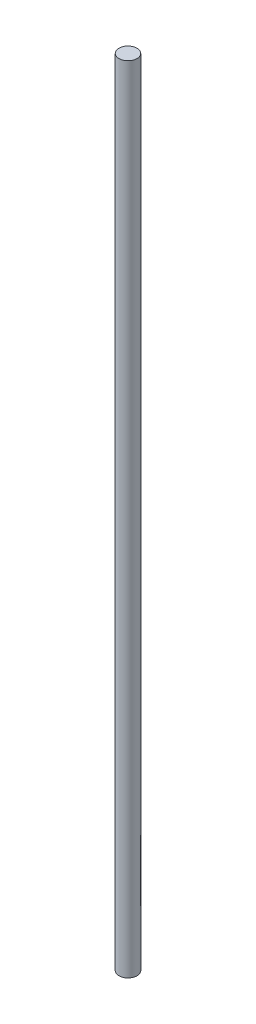
ISO-10303-21;
HEADER;
FILE_DESCRIPTION(('STEP AP214'),'2;1');
FILE_NAME('part.step','',(''),(''),'','','');
FILE_SCHEMA(('AUTOMOTIVE_DESIGN { 1 0 10303 214 1 1 1 1 }'));
ENDSEC;
DATA;
#1=APPLICATION_CONTEXT('core data for automotive mechanical design processes');
#2=APPLICATION_PROTOCOL_DEFINITION('international standard','automotive_design',2000,#1);
#3=PRODUCT_CONTEXT('',#1,'mechanical');
#4=PRODUCT('Part','Part','',(#3));
#5=PRODUCT_RELATED_PRODUCT_CATEGORY('part','',(#4));
#6=PRODUCT_DEFINITION_FORMATION('','',#4);
#7=PRODUCT_DEFINITION_CONTEXT('part definition',#1,'design');
#8=PRODUCT_DEFINITION('design','',#6,#7);
#9=PRODUCT_DEFINITION_SHAPE('','',#8);
#10=(LENGTH_UNIT() NAMED_UNIT(*) SI_UNIT(.MILLI.,.METRE.));
#11=(NAMED_UNIT(*) PLANE_ANGLE_UNIT() SI_UNIT($,.RADIAN.));
#12=(NAMED_UNIT(*) SI_UNIT($,.STERADIAN.) SOLID_ANGLE_UNIT());
#13=UNCERTAINTY_MEASURE_WITH_UNIT(LENGTH_MEASURE(1.E-05),#10,'distance_accuracy_value','');
#14=(GEOMETRIC_REPRESENTATION_CONTEXT(3) GLOBAL_UNCERTAINTY_ASSIGNED_CONTEXT((#13)) GLOBAL_UNIT_ASSIGNED_CONTEXT((#10,
#11,#12)) REPRESENTATION_CONTEXT('',''));
#15=CARTESIAN_POINT('',(0.,0.,0.));
#16=DIRECTION('',(0.,0.,1.));
#17=DIRECTION('',(1.,0.,0.));
#18=AXIS2_PLACEMENT_3D('',#15,#16,#17);
#19=CARTESIAN_POINT('',(0.,558.8,0.));
#20=DIRECTION('',(0.,-1.,0.));
#21=DIRECTION('',(0.,0.,-1.));
#22=AXIS2_PLACEMENT_3D('',#19,#20,#21);
#23=CYLINDRICAL_SURFACE('',#22,6.35);
#24=CARTESIAN_POINT('',(0.,558.8,0.));
#25=DIRECTION('',(0.,1.,0.));
#26=DIRECTION('',(0.,0.,1.));
#27=AXIS2_PLACEMENT_3D('',#24,#25,#26);
#28=CIRCLE('',#27,6.35);
#29=CARTESIAN_POINT('',(0.,558.8,6.35));
#30=VERTEX_POINT('',#29);
#31=EDGE_CURVE('E10',#30,#30,#28,.T.);
#32=ORIENTED_EDGE('',*,*,#31,.F.);
#33=EDGE_LOOP('',(#32));
#34=FACE_BOUND('',#33,.T.);
#35=CARTESIAN_POINT('',(0.,0.,0.));
#36=DIRECTION('',(0.,1.,0.));
#37=DIRECTION('',(0.,0.,1.));
#38=AXIS2_PLACEMENT_3D('',#35,#36,#37);
#39=CIRCLE('',#38,6.35);
#40=CARTESIAN_POINT('',(0.,0.,6.35));
#41=VERTEX_POINT('',#40);
#42=EDGE_CURVE('E38',#41,#41,#39,.T.);
#43=ORIENTED_EDGE('',*,*,#42,.T.);
#44=EDGE_LOOP('',(#43));
#45=FACE_BOUND('',#44,.T.);
#46=ADVANCED_FACE('F35',(#34,#45),#23,.T.);
#47=CARTESIAN_POINT('',(0.,558.8,0.));
#48=DIRECTION('',(0.,1.,0.));
#49=DIRECTION('',(0.,0.,1.));
#50=AXIS2_PLACEMENT_3D('',#47,#48,#49);
#51=PLANE('',#50);
#52=ORIENTED_EDGE('',*,*,#31,.T.);
#53=EDGE_LOOP('',(#52));
#54=FACE_BOUND('',#53,.T.);
#55=ADVANCED_FACE('F50',(#54),#51,.T.);
#56=CARTESIAN_POINT('',(0.,0.,0.));
#57=DIRECTION('',(0.,1.,0.));
#58=DIRECTION('',(0.,0.,1.));
#59=AXIS2_PLACEMENT_3D('',#56,#57,#58);
#60=PLANE('',#59);
#61=ORIENTED_EDGE('',*,*,#42,.F.);
#62=EDGE_LOOP('',(#61));
#63=FACE_BOUND('',#62,.T.);
#64=ADVANCED_FACE('F48',(#63),#60,.F.);
#65=CLOSED_SHELL('',(#46,#55,#64));
#66=MANIFOLD_SOLID_BREP('B2',#65);
#67=ADVANCED_BREP_SHAPE_REPRESENTATION('',(#18,#66),#14);
#68=SHAPE_DEFINITION_REPRESENTATION(#9,#67);
ENDSEC;
END-ISO-10303-21;
